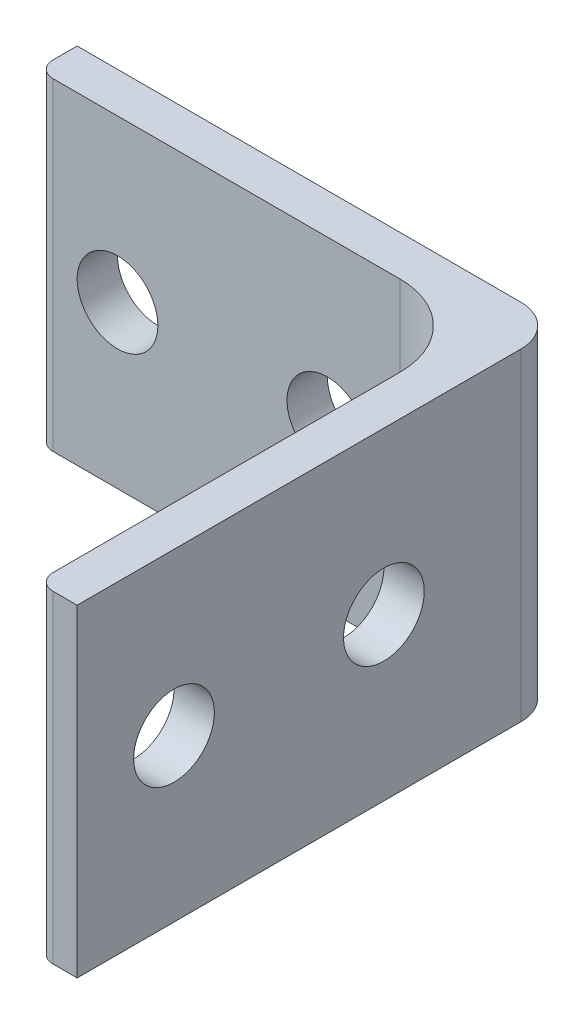
ISO-10303-21;
HEADER;
FILE_DESCRIPTION(('STEP AP214'),'2;1');
FILE_NAME('part.step','',(''),(''),'','','');
FILE_SCHEMA(('AUTOMOTIVE_DESIGN { 1 0 10303 214 1 1 1 1 }'));
ENDSEC;
DATA;
#1=APPLICATION_CONTEXT('core data for automotive mechanical design processes');
#2=APPLICATION_PROTOCOL_DEFINITION('international standard','automotive_design',2000,#1);
#3=PRODUCT_CONTEXT('',#1,'mechanical');
#4=PRODUCT('Part','Part','',(#3));
#5=PRODUCT_RELATED_PRODUCT_CATEGORY('part','',(#4));
#6=PRODUCT_DEFINITION_FORMATION('','',#4);
#7=PRODUCT_DEFINITION_CONTEXT('part definition',#1,'design');
#8=PRODUCT_DEFINITION('design','',#6,#7);
#9=PRODUCT_DEFINITION_SHAPE('','',#8);
#10=(LENGTH_UNIT() NAMED_UNIT(*) SI_UNIT(.MILLI.,.METRE.));
#11=(NAMED_UNIT(*) PLANE_ANGLE_UNIT() SI_UNIT($,.RADIAN.));
#12=(NAMED_UNIT(*) SI_UNIT($,.STERADIAN.) SOLID_ANGLE_UNIT());
#13=UNCERTAINTY_MEASURE_WITH_UNIT(LENGTH_MEASURE(1.E-05),#10,'distance_accuracy_value','');
#14=(GEOMETRIC_REPRESENTATION_CONTEXT(3) GLOBAL_UNCERTAINTY_ASSIGNED_CONTEXT((#13)) GLOBAL_UNIT_ASSIGNED_CONTEXT((#10,
#11,#12)) REPRESENTATION_CONTEXT('',''));
#15=CARTESIAN_POINT('',(0.,0.,0.));
#16=DIRECTION('',(0.,0.,1.));
#17=DIRECTION('',(1.,0.,0.));
#18=AXIS2_PLACEMENT_3D('',#15,#16,#17);
#19=CARTESIAN_POINT('',(0.,-25.4,1.90499999999999));
#20=DIRECTION('',(-1.,0.,0.));
#21=DIRECTION('',(0.,0.,1.));
#22=AXIS2_PLACEMENT_3D('',#19,#20,#21);
#23=PLANE('',#22);
#24=DIRECTION('',(0.,0.,1.));
#25=VECTOR('',#24,1.);
#26=CARTESIAN_POINT('',(0.,0.,1.90499999999999));
#27=LINE('',#26,#25);
#28=CARTESIAN_POINT('',(0.,0.,0.));
#29=VERTEX_POINT('',#28);
#30=CARTESIAN_POINT('',(0.,0.,1.90499999999999));
#31=VERTEX_POINT('',#30);
#32=EDGE_CURVE('E154',#29,#31,#27,.T.);
#33=ORIENTED_EDGE('',*,*,#32,.F.);
#34=DIRECTION('',(0.,1.,0.));
#35=VECTOR('',#34,1.);
#36=CARTESIAN_POINT('',(0.,-25.4,0.));
#37=LINE('',#36,#35);
#38=CARTESIAN_POINT('',(0.,-25.4,0.));
#39=VERTEX_POINT('',#38);
#40=EDGE_CURVE('E11',#39,#29,#37,.T.);
#41=ORIENTED_EDGE('',*,*,#40,.F.);
#42=DIRECTION('',(0.,0.,1.));
#43=VECTOR('',#42,1.);
#44=CARTESIAN_POINT('',(0.,-25.4,1.90499999999999));
#45=LINE('',#44,#43);
#46=CARTESIAN_POINT('',(0.,-25.4,1.90499999999999));
#47=VERTEX_POINT('',#46);
#48=EDGE_CURVE('E191',#39,#47,#45,.T.);
#49=ORIENTED_EDGE('',*,*,#48,.T.);
#50=DIRECTION('',(0.,1.,0.));
#51=VECTOR('',#50,1.);
#52=CARTESIAN_POINT('',(0.,-25.4,1.90499999999999));
#53=LINE('',#52,#51);
#54=EDGE_CURVE('E42',#47,#31,#53,.T.);
#55=ORIENTED_EDGE('',*,*,#54,.T.);
#56=EDGE_LOOP('',(#33,#41,#49,#55));
#57=FACE_BOUND('',#56,.T.);
#58=ADVANCED_FACE('F39',(#57),#23,.T.);
#59=CARTESIAN_POINT('',(0.,-25.4,0.));
#60=DIRECTION('',(0.,0.,-1.));
#61=DIRECTION('',(-1.,0.,0.));
#62=AXIS2_PLACEMENT_3D('',#59,#60,#61);
#63=PLANE('',#62);
#64=CARTESIAN_POINT('',(6.35,-12.7,0.));
#65=DIRECTION('',(0.,0.,-1.));
#66=DIRECTION('',(-1.,0.,0.));
#67=AXIS2_PLACEMENT_3D('',#64,#65,#66);
#68=CIRCLE('',#67,3.175);
#69=CARTESIAN_POINT('',(3.175,-12.7,0.));
#70=VERTEX_POINT('',#69);
#71=EDGE_CURVE('E278',#70,#70,#68,.T.);
#72=ORIENTED_EDGE('',*,*,#71,.F.);
#73=EDGE_LOOP('',(#72));
#74=FACE_BOUND('',#73,.T.);
#75=CARTESIAN_POINT('',(22.86,-12.7,0.));
#76=DIRECTION('',(0.,0.,-1.));
#77=DIRECTION('',(-1.,0.,0.));
#78=AXIS2_PLACEMENT_3D('',#75,#76,#77);
#79=CIRCLE('',#78,3.175);
#80=CARTESIAN_POINT('',(19.685,-12.7,0.));
#81=VERTEX_POINT('',#80);
#82=EDGE_CURVE('E283',#81,#81,#79,.T.);
#83=ORIENTED_EDGE('',*,*,#82,.F.);
#84=EDGE_LOOP('',(#83));
#85=FACE_BOUND('',#84,.T.);
#86=DIRECTION('',(-1.,0.,0.));
#87=VECTOR('',#86,1.);
#88=CARTESIAN_POINT('',(0.,0.,0.));
#89=LINE('',#88,#87);
#90=CARTESIAN_POINT('',(34.925,0.,0.));
#91=VERTEX_POINT('',#90);
#92=EDGE_CURVE('E188',#91,#29,#89,.T.);
#93=ORIENTED_EDGE('',*,*,#92,.F.);
#94=DIRECTION('',(0.,1.,0.));
#95=VECTOR('',#94,1.);
#96=CARTESIAN_POINT('',(34.925,-25.4,0.));
#97=LINE('',#96,#95);
#98=CARTESIAN_POINT('',(34.925,-25.4,0.));
#99=VERTEX_POINT('',#98);
#100=EDGE_CURVE('E49',#99,#91,#97,.T.);
#101=ORIENTED_EDGE('',*,*,#100,.F.);
#102=DIRECTION('',(-1.,0.,0.));
#103=VECTOR('',#102,1.);
#104=CARTESIAN_POINT('',(0.,-25.4,0.));
#105=LINE('',#104,#103);
#106=EDGE_CURVE('E140',#99,#39,#105,.T.);
#107=ORIENTED_EDGE('',*,*,#106,.T.);
#108=ORIENTED_EDGE('',*,*,#40,.T.);
#109=EDGE_LOOP('',(#93,#101,#107,#108));
#110=FACE_BOUND('',#109,.T.);
#111=ADVANCED_FACE('F215',(#74,#85,#110),#63,.T.);
#112=CARTESIAN_POINT('',(34.925,-25.4,3.175));
#113=DIRECTION('',(0.,1.,0.));
#114=DIRECTION('',(0.,0.,1.));
#115=AXIS2_PLACEMENT_3D('',#112,#113,#114);
#116=CYLINDRICAL_SURFACE('',#115,3.175);
#117=CARTESIAN_POINT('',(34.925,0.,3.175));
#118=DIRECTION('',(0.,1.,0.));
#119=DIRECTION('',(0.,0.,-1.));
#120=AXIS2_PLACEMENT_3D('',#117,#118,#119);
#121=CIRCLE('',#120,3.175);
#122=CARTESIAN_POINT('',(38.1,0.,3.17500000000002));
#123=VERTEX_POINT('',#122);
#124=EDGE_CURVE('E126',#123,#91,#121,.T.);
#125=ORIENTED_EDGE('',*,*,#124,.F.);
#126=DIRECTION('',(0.,1.,0.));
#127=VECTOR('',#126,1.);
#128=CARTESIAN_POINT('',(38.1,-25.4,3.17500000000002));
#129=LINE('',#128,#127);
#130=CARTESIAN_POINT('',(38.1,-25.4,3.17500000000002));
#131=VERTEX_POINT('',#130);
#132=EDGE_CURVE('E121',#131,#123,#129,.T.);
#133=ORIENTED_EDGE('',*,*,#132,.F.);
#134=CARTESIAN_POINT('',(34.925,-25.4,3.175));
#135=DIRECTION('',(0.,1.,0.));
#136=DIRECTION('',(0.,0.,-1.));
#137=AXIS2_PLACEMENT_3D('',#134,#135,#136);
#138=CIRCLE('',#137,3.175);
#139=EDGE_CURVE('E124',#131,#99,#138,.T.);
#140=ORIENTED_EDGE('',*,*,#139,.T.);
#141=ORIENTED_EDGE('',*,*,#100,.T.);
#142=EDGE_LOOP('',(#125,#133,#140,#141));
#143=FACE_BOUND('',#142,.T.);
#144=ADVANCED_FACE('F123',(#143),#116,.T.);
#145=CARTESIAN_POINT('',(38.1,-25.4,3.17500000000002));
#146=DIRECTION('',(1.,0.,0.));
#147=DIRECTION('',(0.,0.,-1.));
#148=AXIS2_PLACEMENT_3D('',#145,#146,#147);
#149=PLANE('',#148);
#150=CARTESIAN_POINT('',(38.1,-12.7,30.48));
#151=DIRECTION('',(1.,0.,0.));
#152=DIRECTION('',(0.,0.,-1.));
#153=AXIS2_PLACEMENT_3D('',#150,#151,#152);
#154=CIRCLE('',#153,3.175);
#155=CARTESIAN_POINT('',(38.1,-12.7,27.305));
#156=VERTEX_POINT('',#155);
#157=EDGE_CURVE('E159',#156,#156,#154,.T.);
#158=ORIENTED_EDGE('',*,*,#157,.F.);
#159=EDGE_LOOP('',(#158));
#160=FACE_BOUND('',#159,.T.);
#161=CARTESIAN_POINT('',(38.1,-12.7,13.97));
#162=DIRECTION('',(1.,0.,0.));
#163=DIRECTION('',(0.,0.,-1.));
#164=AXIS2_PLACEMENT_3D('',#161,#162,#163);
#165=CIRCLE('',#164,3.175);
#166=CARTESIAN_POINT('',(38.1,-12.7,10.795));
#167=VERTEX_POINT('',#166);
#168=EDGE_CURVE('E300',#167,#167,#165,.T.);
#169=ORIENTED_EDGE('',*,*,#168,.F.);
#170=EDGE_LOOP('',(#169));
#171=FACE_BOUND('',#170,.T.);
#172=DIRECTION('',(0.,0.,-1.));
#173=VECTOR('',#172,1.);
#174=CARTESIAN_POINT('',(38.1,0.,3.17500000000002));
#175=LINE('',#174,#173);
#176=CARTESIAN_POINT('',(38.1,0.,38.1));
#177=VERTEX_POINT('',#176);
#178=EDGE_CURVE('E183',#177,#123,#175,.T.);
#179=ORIENTED_EDGE('',*,*,#178,.F.);
#180=DIRECTION('',(0.,1.,0.));
#181=VECTOR('',#180,1.);
#182=CARTESIAN_POINT('',(38.1,-25.4,38.1));
#183=LINE('',#182,#181);
#184=CARTESIAN_POINT('',(38.1,-25.4,38.1));
#185=VERTEX_POINT('',#184);
#186=EDGE_CURVE('E132',#185,#177,#183,.T.);
#187=ORIENTED_EDGE('',*,*,#186,.F.);
#188=DIRECTION('',(0.,0.,-1.));
#189=VECTOR('',#188,1.);
#190=CARTESIAN_POINT('',(38.1,-25.4,3.17500000000002));
#191=LINE('',#190,#189);
#192=EDGE_CURVE('E138',#185,#131,#191,.T.);
#193=ORIENTED_EDGE('',*,*,#192,.T.);
#194=ORIENTED_EDGE('',*,*,#132,.T.);
#195=EDGE_LOOP('',(#179,#187,#193,#194));
#196=FACE_BOUND('',#195,.T.);
#197=ADVANCED_FACE('F143',(#160,#171,#196),#149,.T.);
#198=CARTESIAN_POINT('',(38.1,-25.4,38.1));
#199=DIRECTION('',(0.,0.,1.));
#200=DIRECTION('',(1.,0.,0.));
#201=AXIS2_PLACEMENT_3D('',#198,#199,#200);
#202=PLANE('',#201);
#203=DIRECTION('',(1.,0.,0.));
#204=VECTOR('',#203,1.);
#205=CARTESIAN_POINT('',(38.1,0.,38.1));
#206=LINE('',#205,#204);
#207=CARTESIAN_POINT('',(36.195,0.,38.1));
#208=VERTEX_POINT('',#207);
#209=EDGE_CURVE('E179',#208,#177,#206,.T.);
#210=ORIENTED_EDGE('',*,*,#209,.F.);
#211=DIRECTION('',(0.,1.,0.));
#212=VECTOR('',#211,1.);
#213=CARTESIAN_POINT('',(36.195,-25.4,38.1));
#214=LINE('',#213,#212);
#215=CARTESIAN_POINT('',(36.195,-25.4,38.1));
#216=VERTEX_POINT('',#215);
#217=EDGE_CURVE('E197',#216,#208,#214,.T.);
#218=ORIENTED_EDGE('',*,*,#217,.F.);
#219=DIRECTION('',(1.,0.,0.));
#220=VECTOR('',#219,1.);
#221=CARTESIAN_POINT('',(38.1,-25.4,38.1));
#222=LINE('',#221,#220);
#223=EDGE_CURVE('E145',#216,#185,#222,.T.);
#224=ORIENTED_EDGE('',*,*,#223,.T.);
#225=ORIENTED_EDGE('',*,*,#186,.T.);
#226=EDGE_LOOP('',(#210,#218,#224,#225));
#227=FACE_BOUND('',#226,.T.);
#228=ADVANCED_FACE('F231',(#227),#202,.T.);
#229=CARTESIAN_POINT('',(36.195,-25.4,36.83));
#230=DIRECTION('',(0.,1.,0.));
#231=DIRECTION('',(0.,0.,1.));
#232=AXIS2_PLACEMENT_3D('',#229,#230,#231);
#233=CYLINDRICAL_SURFACE('',#232,1.27);
#234=CARTESIAN_POINT('',(36.195,0.,36.83));
#235=DIRECTION('',(0.,1.,0.));
#236=DIRECTION('',(0.,0.,-1.));
#237=AXIS2_PLACEMENT_3D('',#234,#235,#236);
#238=CIRCLE('',#237,1.27);
#239=CARTESIAN_POINT('',(34.925,0.,36.83));
#240=VERTEX_POINT('',#239);
#241=EDGE_CURVE('E175',#240,#208,#238,.T.);
#242=ORIENTED_EDGE('',*,*,#241,.F.);
#243=DIRECTION('',(0.,1.,0.));
#244=VECTOR('',#243,1.);
#245=CARTESIAN_POINT('',(34.925,-25.4,36.83));
#246=LINE('',#245,#244);
#247=CARTESIAN_POINT('',(34.925,-25.4,36.83));
#248=VERTEX_POINT('',#247);
#249=EDGE_CURVE('E200',#248,#240,#246,.T.);
#250=ORIENTED_EDGE('',*,*,#249,.F.);
#251=CARTESIAN_POINT('',(36.195,-25.4,36.83));
#252=DIRECTION('',(0.,1.,0.));
#253=DIRECTION('',(0.,0.,-1.));
#254=AXIS2_PLACEMENT_3D('',#251,#252,#253);
#255=CIRCLE('',#254,1.27);
#256=EDGE_CURVE('E148',#248,#216,#255,.T.);
#257=ORIENTED_EDGE('',*,*,#256,.T.);
#258=ORIENTED_EDGE('',*,*,#217,.T.);
#259=EDGE_LOOP('',(#242,#250,#257,#258));
#260=FACE_BOUND('',#259,.T.);
#261=ADVANCED_FACE('F235',(#260),#233,.T.);
#262=CARTESIAN_POINT('',(34.925,-25.4,36.83));
#263=DIRECTION('',(-1.,0.,0.));
#264=DIRECTION('',(0.,0.,1.));
#265=AXIS2_PLACEMENT_3D('',#262,#263,#264);
#266=PLANE('',#265);
#267=CARTESIAN_POINT('',(34.925,-12.7,30.48));
#268=DIRECTION('',(-1.,0.,0.));
#269=DIRECTION('',(0.,0.,1.));
#270=AXIS2_PLACEMENT_3D('',#267,#268,#269);
#271=CIRCLE('',#270,3.175);
#272=CARTESIAN_POINT('',(34.925,-12.7,33.655));
#273=VERTEX_POINT('',#272);
#274=EDGE_CURVE('E296',#273,#273,#271,.T.);
#275=ORIENTED_EDGE('',*,*,#274,.F.);
#276=EDGE_LOOP('',(#275));
#277=FACE_BOUND('',#276,.T.);
#278=CARTESIAN_POINT('',(34.925,-12.7,13.97));
#279=DIRECTION('',(-1.,0.,0.));
#280=DIRECTION('',(0.,0.,1.));
#281=AXIS2_PLACEMENT_3D('',#278,#279,#280);
#282=CIRCLE('',#281,3.175);
#283=CARTESIAN_POINT('',(34.925,-12.7,17.145));
#284=VERTEX_POINT('',#283);
#285=EDGE_CURVE('E295',#284,#284,#282,.T.);
#286=ORIENTED_EDGE('',*,*,#285,.F.);
#287=EDGE_LOOP('',(#286));
#288=FACE_BOUND('',#287,.T.);
#289=DIRECTION('',(0.,0.,1.));
#290=VECTOR('',#289,1.);
#291=CARTESIAN_POINT('',(34.925,0.,36.83));
#292=LINE('',#291,#290);
#293=CARTESIAN_POINT('',(34.925,0.,9.52500000000004));
#294=VERTEX_POINT('',#293);
#295=EDGE_CURVE('E171',#294,#240,#292,.T.);
#296=ORIENTED_EDGE('',*,*,#295,.F.);
#297=DIRECTION('',(0.,1.,0.));
#298=VECTOR('',#297,1.);
#299=CARTESIAN_POINT('',(34.925,-25.4,9.52500000000004));
#300=LINE('',#299,#298);
#301=CARTESIAN_POINT('',(34.925,-25.4,9.52500000000004));
#302=VERTEX_POINT('',#301);
#303=EDGE_CURVE('E203',#302,#294,#300,.T.);
#304=ORIENTED_EDGE('',*,*,#303,.F.);
#305=DIRECTION('',(0.,0.,1.));
#306=VECTOR('',#305,1.);
#307=CARTESIAN_POINT('',(34.925,-25.4,36.83));
#308=LINE('',#307,#306);
#309=EDGE_CURVE('E323',#302,#248,#308,.T.);
#310=ORIENTED_EDGE('',*,*,#309,.T.);
#311=ORIENTED_EDGE('',*,*,#249,.T.);
#312=EDGE_LOOP('',(#296,#304,#310,#311));
#313=FACE_BOUND('',#312,.T.);
#314=ADVANCED_FACE('F239',(#277,#288,#313),#266,.T.);
#315=CARTESIAN_POINT('',(28.575,-25.4,9.525));
#316=DIRECTION('',(0.,1.,0.));
#317=DIRECTION('',(0.,0.,1.));
#318=AXIS2_PLACEMENT_3D('',#315,#316,#317);
#319=CYLINDRICAL_SURFACE('',#318,6.35);
#320=CARTESIAN_POINT('',(28.575,0.,9.525));
#321=DIRECTION('',(0.,-1.,0.));
#322=DIRECTION('',(0.,0.,1.));
#323=AXIS2_PLACEMENT_3D('',#320,#321,#322);
#324=CIRCLE('',#323,6.35);
#325=CARTESIAN_POINT('',(28.575,0.,3.175));
#326=VERTEX_POINT('',#325);
#327=EDGE_CURVE('E167',#326,#294,#324,.T.);
#328=ORIENTED_EDGE('',*,*,#327,.F.);
#329=DIRECTION('',(0.,1.,0.));
#330=VECTOR('',#329,1.);
#331=CARTESIAN_POINT('',(28.575,-25.4,3.175));
#332=LINE('',#331,#330);
#333=CARTESIAN_POINT('',(28.575,-25.4,3.175));
#334=VERTEX_POINT('',#333);
#335=EDGE_CURVE('E206',#334,#326,#332,.T.);
#336=ORIENTED_EDGE('',*,*,#335,.F.);
#337=CARTESIAN_POINT('',(28.575,-25.4,9.525));
#338=DIRECTION('',(0.,-1.,0.));
#339=DIRECTION('',(0.,0.,1.));
#340=AXIS2_PLACEMENT_3D('',#337,#338,#339);
#341=CIRCLE('',#340,6.35);
#342=EDGE_CURVE('E319',#334,#302,#341,.T.);
#343=ORIENTED_EDGE('',*,*,#342,.T.);
#344=ORIENTED_EDGE('',*,*,#303,.T.);
#345=EDGE_LOOP('',(#328,#336,#343,#344));
#346=FACE_BOUND('',#345,.T.);
#347=ADVANCED_FACE('F243',(#346),#319,.F.);
#348=CARTESIAN_POINT('',(28.575,-25.4,3.175));
#349=DIRECTION('',(0.,0.,1.));
#350=DIRECTION('',(1.,0.,0.));
#351=AXIS2_PLACEMENT_3D('',#348,#349,#350);
#352=PLANE('',#351);
#353=CARTESIAN_POINT('',(6.35,-12.7,3.175));
#354=DIRECTION('',(0.,0.,1.));
#355=DIRECTION('',(1.,0.,0.));
#356=AXIS2_PLACEMENT_3D('',#353,#354,#355);
#357=CIRCLE('',#356,3.175);
#358=CARTESIAN_POINT('',(9.525,-12.7,3.175));
#359=VERTEX_POINT('',#358);
#360=EDGE_CURVE('E281',#359,#359,#357,.T.);
#361=ORIENTED_EDGE('',*,*,#360,.F.);
#362=EDGE_LOOP('',(#361));
#363=FACE_BOUND('',#362,.T.);
#364=CARTESIAN_POINT('',(22.86,-12.7,3.175));
#365=DIRECTION('',(0.,0.,1.));
#366=DIRECTION('',(1.,0.,0.));
#367=AXIS2_PLACEMENT_3D('',#364,#365,#366);
#368=CIRCLE('',#367,3.175);
#369=CARTESIAN_POINT('',(26.035,-12.7,3.175));
#370=VERTEX_POINT('',#369);
#371=EDGE_CURVE('E284',#370,#370,#368,.T.);
#372=ORIENTED_EDGE('',*,*,#371,.F.);
#373=EDGE_LOOP('',(#372));
#374=FACE_BOUND('',#373,.T.);
#375=DIRECTION('',(1.,0.,0.));
#376=VECTOR('',#375,1.);
#377=CARTESIAN_POINT('',(28.575,0.,3.175));
#378=LINE('',#377,#376);
#379=CARTESIAN_POINT('',(1.27000000000001,0.,3.175));
#380=VERTEX_POINT('',#379);
#381=EDGE_CURVE('E163',#380,#326,#378,.T.);
#382=ORIENTED_EDGE('',*,*,#381,.F.);
#383=DIRECTION('',(0.,1.,0.));
#384=VECTOR('',#383,1.);
#385=CARTESIAN_POINT('',(1.27000000000001,-25.4,3.175));
#386=LINE('',#385,#384);
#387=CARTESIAN_POINT('',(1.27000000000001,-25.4,3.175));
#388=VERTEX_POINT('',#387);
#389=EDGE_CURVE('E208',#388,#380,#386,.T.);
#390=ORIENTED_EDGE('',*,*,#389,.F.);
#391=DIRECTION('',(1.,0.,0.));
#392=VECTOR('',#391,1.);
#393=CARTESIAN_POINT('',(28.575,-25.4,3.175));
#394=LINE('',#393,#392);
#395=EDGE_CURVE('E315',#388,#334,#394,.T.);
#396=ORIENTED_EDGE('',*,*,#395,.T.);
#397=ORIENTED_EDGE('',*,*,#335,.T.);
#398=EDGE_LOOP('',(#382,#390,#396,#397));
#399=FACE_BOUND('',#398,.T.);
#400=ADVANCED_FACE('F247',(#363,#374,#399),#352,.T.);
#401=CARTESIAN_POINT('',(1.27,-25.4,1.905));
#402=DIRECTION('',(0.,1.,0.));
#403=DIRECTION('',(0.,0.,1.));
#404=AXIS2_PLACEMENT_3D('',#401,#402,#403);
#405=CYLINDRICAL_SURFACE('',#404,1.27);
#406=CARTESIAN_POINT('',(1.27,0.,1.905));
#407=DIRECTION('',(0.,1.,0.));
#408=DIRECTION('',(0.,0.,-1.));
#409=AXIS2_PLACEMENT_3D('',#406,#407,#408);
#410=CIRCLE('',#409,1.27);
#411=EDGE_CURVE('E158',#31,#380,#410,.T.);
#412=ORIENTED_EDGE('',*,*,#411,.F.);
#413=ORIENTED_EDGE('',*,*,#54,.F.);
#414=CARTESIAN_POINT('',(1.27,-25.4,1.905));
#415=DIRECTION('',(0.,1.,0.));
#416=DIRECTION('',(0.,0.,-1.));
#417=AXIS2_PLACEMENT_3D('',#414,#415,#416);
#418=CIRCLE('',#417,1.27);
#419=EDGE_CURVE('E312',#47,#388,#418,.T.);
#420=ORIENTED_EDGE('',*,*,#419,.T.);
#421=ORIENTED_EDGE('',*,*,#389,.T.);
#422=EDGE_LOOP('',(#412,#413,#420,#421));
#423=FACE_BOUND('',#422,.T.);
#424=ADVANCED_FACE('F212',(#423),#405,.T.);
#425=CARTESIAN_POINT('',(34.925,-25.4,3.175));
#426=DIRECTION('',(0.,-1.,0.));
#427=DIRECTION('',(0.,0.,-1.));
#428=AXIS2_PLACEMENT_3D('',#425,#426,#427);
#429=PLANE('',#428);
#430=ORIENTED_EDGE('',*,*,#48,.F.);
#431=ORIENTED_EDGE('',*,*,#106,.F.);
#432=ORIENTED_EDGE('',*,*,#139,.F.);
#433=ORIENTED_EDGE('',*,*,#192,.F.);
#434=ORIENTED_EDGE('',*,*,#223,.F.);
#435=ORIENTED_EDGE('',*,*,#256,.F.);
#436=ORIENTED_EDGE('',*,*,#309,.F.);
#437=ORIENTED_EDGE('',*,*,#342,.F.);
#438=ORIENTED_EDGE('',*,*,#395,.F.);
#439=ORIENTED_EDGE('',*,*,#419,.F.);
#440=EDGE_LOOP('',(#430,#431,#432,#433,#434,#435,#436,#437,#438,#439));
#441=FACE_BOUND('',#440,.T.);
#442=ADVANCED_FACE('F136',(#441),#429,.T.);
#443=CARTESIAN_POINT('',(34.925,0.,3.175));
#444=DIRECTION('',(0.,-1.,0.));
#445=DIRECTION('',(0.,0.,-1.));
#446=AXIS2_PLACEMENT_3D('',#443,#444,#445);
#447=PLANE('',#446);
#448=ORIENTED_EDGE('',*,*,#32,.T.);
#449=ORIENTED_EDGE('',*,*,#411,.T.);
#450=ORIENTED_EDGE('',*,*,#381,.T.);
#451=ORIENTED_EDGE('',*,*,#327,.T.);
#452=ORIENTED_EDGE('',*,*,#295,.T.);
#453=ORIENTED_EDGE('',*,*,#241,.T.);
#454=ORIENTED_EDGE('',*,*,#209,.T.);
#455=ORIENTED_EDGE('',*,*,#178,.T.);
#456=ORIENTED_EDGE('',*,*,#124,.T.);
#457=ORIENTED_EDGE('',*,*,#92,.T.);
#458=EDGE_LOOP('',(#448,#449,#450,#451,#452,#453,#454,#455,#456,#457));
#459=FACE_BOUND('',#458,.T.);
#460=ADVANCED_FACE('F214',(#459),#447,.F.);
#461=CARTESIAN_POINT('',(60.325,-12.7,13.97));
#462=DIRECTION('',(-1.,0.,0.));
#463=DIRECTION('',(0.,0.,1.));
#464=AXIS2_PLACEMENT_3D('',#461,#462,#463);
#465=CYLINDRICAL_SURFACE('',#464,3.175);
#466=ORIENTED_EDGE('',*,*,#168,.T.);
#467=EDGE_LOOP('',(#466));
#468=FACE_BOUND('',#467,.T.);
#469=ORIENTED_EDGE('',*,*,#285,.T.);
#470=EDGE_LOOP('',(#469));
#471=FACE_BOUND('',#470,.T.);
#472=ADVANCED_FACE('F258',(#468,#471),#465,.F.);
#473=CARTESIAN_POINT('',(60.325,-12.7,30.48));
#474=DIRECTION('',(-1.,0.,0.));
#475=DIRECTION('',(0.,0.,1.));
#476=AXIS2_PLACEMENT_3D('',#473,#474,#475);
#477=CYLINDRICAL_SURFACE('',#476,3.175);
#478=ORIENTED_EDGE('',*,*,#157,.T.);
#479=EDGE_LOOP('',(#478));
#480=FACE_BOUND('',#479,.T.);
#481=ORIENTED_EDGE('',*,*,#274,.T.);
#482=EDGE_LOOP('',(#481));
#483=FACE_BOUND('',#482,.T.);
#484=ADVANCED_FACE('F262',(#480,#483),#477,.F.);
#485=CARTESIAN_POINT('',(22.86,-12.7,-22.225));
#486=DIRECTION('',(0.,0.,1.));
#487=DIRECTION('',(1.,0.,0.));
#488=AXIS2_PLACEMENT_3D('',#485,#486,#487);
#489=CYLINDRICAL_SURFACE('',#488,3.175);
#490=ORIENTED_EDGE('',*,*,#82,.T.);
#491=EDGE_LOOP('',(#490));
#492=FACE_BOUND('',#491,.T.);
#493=ORIENTED_EDGE('',*,*,#371,.T.);
#494=EDGE_LOOP('',(#493));
#495=FACE_BOUND('',#494,.T.);
#496=ADVANCED_FACE('F266',(#492,#495),#489,.F.);
#497=CARTESIAN_POINT('',(6.35,-12.7,-22.225));
#498=DIRECTION('',(0.,0.,1.));
#499=DIRECTION('',(1.,0.,0.));
#500=AXIS2_PLACEMENT_3D('',#497,#498,#499);
#501=CYLINDRICAL_SURFACE('',#500,3.175);
#502=ORIENTED_EDGE('',*,*,#71,.T.);
#503=EDGE_LOOP('',(#502));
#504=FACE_BOUND('',#503,.T.);
#505=ORIENTED_EDGE('',*,*,#360,.T.);
#506=EDGE_LOOP('',(#505));
#507=FACE_BOUND('',#506,.T.);
#508=ADVANCED_FACE('F270',(#504,#507),#501,.F.);
#509=CLOSED_SHELL('',(#58,#111,#144,#197,#228,#261,#314,#347,#400,#424,#442,#460,#472,#484,#496,#508));
#510=MANIFOLD_SOLID_BREP('B2',#509);
#511=ADVANCED_BREP_SHAPE_REPRESENTATION('',(#18,#510),#14);
#512=SHAPE_DEFINITION_REPRESENTATION(#9,#511);
ENDSEC;
END-ISO-10303-21;
